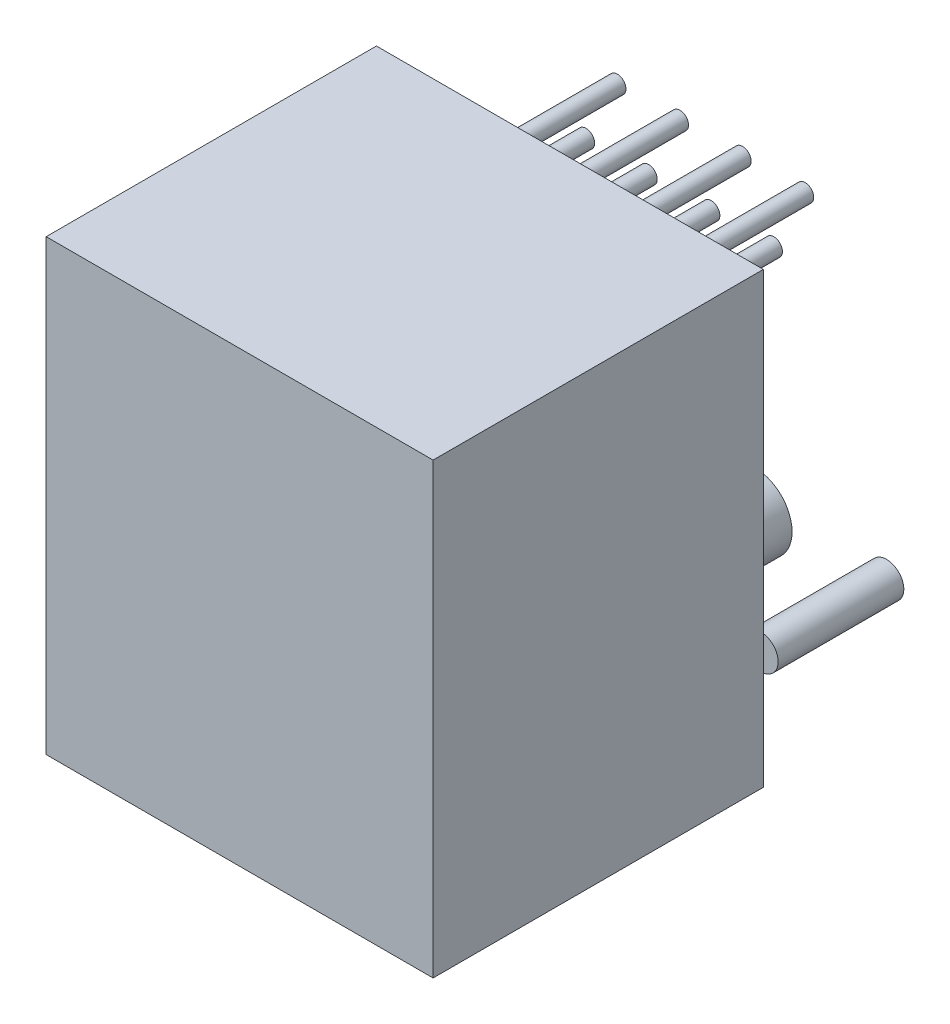
ISO-10303-21;
HEADER;
FILE_DESCRIPTION(('STEP AP214'),'2;1');
FILE_NAME('part.step','',(''),(''),'','','');
FILE_SCHEMA(('AUTOMOTIVE_DESIGN { 1 0 10303 214 1 1 1 1 }'));
ENDSEC;
DATA;
#1=APPLICATION_CONTEXT('core data for automotive mechanical design processes');
#2=APPLICATION_PROTOCOL_DEFINITION('international standard','automotive_design',2000,#1);
#3=PRODUCT_CONTEXT('',#1,'mechanical');
#4=PRODUCT('Part','Part','',(#3));
#5=PRODUCT_RELATED_PRODUCT_CATEGORY('part','',(#4));
#6=PRODUCT_DEFINITION_FORMATION('','',#4);
#7=PRODUCT_DEFINITION_CONTEXT('part definition',#1,'design');
#8=PRODUCT_DEFINITION('design','',#6,#7);
#9=PRODUCT_DEFINITION_SHAPE('','',#8);
#10=(LENGTH_UNIT() NAMED_UNIT(*) SI_UNIT(.MILLI.,.METRE.));
#11=(NAMED_UNIT(*) PLANE_ANGLE_UNIT() SI_UNIT($,.RADIAN.));
#12=(NAMED_UNIT(*) SI_UNIT($,.STERADIAN.) SOLID_ANGLE_UNIT());
#13=UNCERTAINTY_MEASURE_WITH_UNIT(LENGTH_MEASURE(1.E-05),#10,'distance_accuracy_value','');
#14=(GEOMETRIC_REPRESENTATION_CONTEXT(3) GLOBAL_UNCERTAINTY_ASSIGNED_CONTEXT((#13)) GLOBAL_UNIT_ASSIGNED_CONTEXT((#10,
#11,#12)) REPRESENTATION_CONTEXT('',''));
#15=CARTESIAN_POINT('',(0.,0.,0.));
#16=DIRECTION('',(0.,0.,1.));
#17=DIRECTION('',(1.,0.,0.));
#18=AXIS2_PLACEMENT_3D('',#15,#16,#17);
#19=CARTESIAN_POINT('',(-1.27,-6.35,0.1));
#20=DIRECTION('',(0.,0.,1.));
#21=DIRECTION('',(1.,0.,0.));
#22=AXIS2_PLACEMENT_3D('',#19,#20,#21);
#23=PLANE('',#22);
#24=CARTESIAN_POINT('',(-1.27,-6.35,0.1));
#25=DIRECTION('',(0.,0.,1.));
#26=DIRECTION('',(1.,0.,0.));
#27=AXIS2_PLACEMENT_3D('',#24,#25,#26);
#28=CIRCLE('',#27,1.5);
#29=CARTESIAN_POINT('',(0.23,-6.35,0.1));
#30=VERTEX_POINT('',#29);
#31=EDGE_CURVE('P0_E18',#30,#30,#28,.F.);
#32=ORIENTED_EDGE('',*,*,#31,.F.);
#33=EDGE_LOOP('',(#32));
#34=FACE_BOUND('',#33,.T.);
#35=ADVANCED_FACE('P0_F15',(#34),#23,.T.);
#36=CARTESIAN_POINT('',(-1.27,-6.35,-1.7));
#37=DIRECTION('',(0.,0.,1.));
#38=DIRECTION('',(1.,0.,0.));
#39=AXIS2_PLACEMENT_3D('',#36,#37,#38);
#40=PLANE('',#39);
#41=CARTESIAN_POINT('',(-1.27,-6.35,-1.7));
#42=DIRECTION('',(0.,0.,1.));
#43=DIRECTION('',(1.,0.,0.));
#44=AXIS2_PLACEMENT_3D('',#41,#42,#43);
#45=CIRCLE('',#44,1.5);
#46=CARTESIAN_POINT('',(0.23,-6.35,-1.7));
#47=VERTEX_POINT('',#46);
#48=EDGE_CURVE('P0_E10',#47,#47,#45,.T.);
#49=ORIENTED_EDGE('',*,*,#48,.F.);
#50=EDGE_LOOP('',(#49));
#51=FACE_BOUND('',#50,.T.);
#52=ADVANCED_FACE('P0_F30',(#51),#40,.F.);
#53=CARTESIAN_POINT('',(-1.27,-6.35,-1.7));
#54=DIRECTION('',(0.,0.,1.));
#55=DIRECTION('',(1.,0.,0.));
#56=AXIS2_PLACEMENT_3D('',#53,#54,#55);
#57=CYLINDRICAL_SURFACE('',#56,1.5);
#58=ORIENTED_EDGE('',*,*,#48,.T.);
#59=EDGE_LOOP('',(#58));
#60=FACE_BOUND('',#59,.T.);
#61=ORIENTED_EDGE('',*,*,#31,.T.);
#62=EDGE_LOOP('',(#61));
#63=FACE_BOUND('',#62,.T.);
#64=ADVANCED_FACE('P0_F27',(#60,#63),#57,.T.);
#65=CLOSED_SHELL('',(#35,#52,#64));
#66=MANIFOLD_SOLID_BREP('P0_B1',#65);
#67=CARTESIAN_POINT('',(-3.305,-9.4,0.1));
#68=DIRECTION('',(0.,0.,1.));
#69=DIRECTION('',(1.,0.,0.));
#70=AXIS2_PLACEMENT_3D('',#67,#68,#69);
#71=PLANE('',#70);
#72=CARTESIAN_POINT('',(-3.305,-9.4,0.1));
#73=DIRECTION('',(0.,0.,1.));
#74=DIRECTION('',(1.,0.,0.));
#75=AXIS2_PLACEMENT_3D('',#72,#73,#74);
#76=CIRCLE('',#75,0.7);
#77=CARTESIAN_POINT('',(-2.605,-9.4,0.1));
#78=VERTEX_POINT('',#77);
#79=EDGE_CURVE('P1_E18',#78,#78,#76,.F.);
#80=ORIENTED_EDGE('',*,*,#79,.F.);
#81=EDGE_LOOP('',(#80));
#82=FACE_BOUND('',#81,.T.);
#83=ADVANCED_FACE('P1_F15',(#82),#71,.T.);
#84=CARTESIAN_POINT('',(-3.305,-9.4,-5.));
#85=DIRECTION('',(0.,0.,1.));
#86=DIRECTION('',(1.,0.,0.));
#87=AXIS2_PLACEMENT_3D('',#84,#85,#86);
#88=PLANE('',#87);
#89=CARTESIAN_POINT('',(-3.305,-9.4,-5.));
#90=DIRECTION('',(0.,0.,1.));
#91=DIRECTION('',(1.,0.,0.));
#92=AXIS2_PLACEMENT_3D('',#89,#90,#91);
#93=CIRCLE('',#92,0.7);
#94=CARTESIAN_POINT('',(-2.605,-9.4,-5.));
#95=VERTEX_POINT('',#94);
#96=EDGE_CURVE('P1_E10',#95,#95,#93,.T.);
#97=ORIENTED_EDGE('',*,*,#96,.F.);
#98=EDGE_LOOP('',(#97));
#99=FACE_BOUND('',#98,.T.);
#100=ADVANCED_FACE('P1_F30',(#99),#88,.F.);
#101=CARTESIAN_POINT('',(-3.305,-9.4,-5.));
#102=DIRECTION('',(0.,0.,1.));
#103=DIRECTION('',(1.,0.,0.));
#104=AXIS2_PLACEMENT_3D('',#101,#102,#103);
#105=CYLINDRICAL_SURFACE('',#104,0.7);
#106=ORIENTED_EDGE('',*,*,#96,.T.);
#107=EDGE_LOOP('',(#106));
#108=FACE_BOUND('',#107,.T.);
#109=ORIENTED_EDGE('',*,*,#79,.T.);
#110=EDGE_LOOP('',(#109));
#111=FACE_BOUND('',#110,.T.);
#112=ADVANCED_FACE('P1_F27',(#108,#111),#105,.T.);
#113=CLOSED_SHELL('',(#83,#100,#112));
#114=MANIFOLD_SOLID_BREP('P1_B1',#113);
#115=CARTESIAN_POINT('',(4.445,-5.01,13.5));
#116=DIRECTION('',(0.,0.,-1.));
#117=DIRECTION('',(-1.,0.,0.));
#118=AXIS2_PLACEMENT_3D('',#115,#116,#117);
#119=PLANE('',#118);
#120=DIRECTION('',(1.,0.,0.));
#121=VECTOR('',#120,1.);
#122=CARTESIAN_POINT('',(12.295,-14.11,13.5));
#123=LINE('',#122,#121);
#124=CARTESIAN_POINT('',(12.295,-14.11,13.5));
#125=VERTEX_POINT('',#124);
#126=CARTESIAN_POINT('',(-3.405,-14.11,13.5));
#127=VERTEX_POINT('',#126);
#128=EDGE_CURVE('P2_E68',#125,#127,#123,.F.);
#129=ORIENTED_EDGE('',*,*,#128,.F.);
#130=DIRECTION('',(0.,1.,0.));
#131=VECTOR('',#130,1.);
#132=CARTESIAN_POINT('',(12.295,4.09,13.5));
#133=LINE('',#132,#131);
#134=CARTESIAN_POINT('',(12.295,4.09,13.5));
#135=VERTEX_POINT('',#134);
#136=EDGE_CURVE('P2_E55',#135,#125,#133,.F.);
#137=ORIENTED_EDGE('',*,*,#136,.F.);
#138=DIRECTION('',(1.,0.,0.));
#139=VECTOR('',#138,1.);
#140=CARTESIAN_POINT('',(-3.405,4.09,13.5));
#141=LINE('',#140,#139);
#142=CARTESIAN_POINT('',(-3.405,4.09,13.5));
#143=VERTEX_POINT('',#142);
#144=EDGE_CURVE('P2_E20',#143,#135,#141,.T.);
#145=ORIENTED_EDGE('',*,*,#144,.F.);
#146=DIRECTION('',(0.,1.,0.));
#147=VECTOR('',#146,1.);
#148=CARTESIAN_POINT('',(-3.405,-14.11,13.5));
#149=LINE('',#148,#147);
#150=EDGE_CURVE('P2_E80',#127,#143,#149,.T.);
#151=ORIENTED_EDGE('',*,*,#150,.F.);
#152=EDGE_LOOP('',(#129,#137,#145,#151));
#153=FACE_BOUND('',#152,.T.);
#154=ADVANCED_FACE('P2_F17',(#153),#119,.F.);
#155=CARTESIAN_POINT('',(-3.405,4.09,0.1));
#156=DIRECTION('',(0.,1.,0.));
#157=DIRECTION('',(0.,0.,1.));
#158=AXIS2_PLACEMENT_3D('',#155,#156,#157);
#159=PLANE('',#158);
#160=DIRECTION('',(0.,0.,-1.));
#161=VECTOR('',#160,1.);
#162=CARTESIAN_POINT('',(12.295,4.09,0.1));
#163=LINE('',#162,#161);
#164=CARTESIAN_POINT('',(12.295,4.09,0.1));
#165=VERTEX_POINT('',#164);
#166=EDGE_CURVE('P2_E61',#165,#135,#163,.F.);
#167=ORIENTED_EDGE('',*,*,#166,.F.);
#168=DIRECTION('',(-1.,0.,0.));
#169=VECTOR('',#168,1.);
#170=CARTESIAN_POINT('',(4.445,4.09,0.1));
#171=LINE('',#170,#169);
#172=CARTESIAN_POINT('',(-3.405,4.09,0.1));
#173=VERTEX_POINT('',#172);
#174=EDGE_CURVE('P2_E83',#173,#165,#171,.F.);
#175=ORIENTED_EDGE('',*,*,#174,.F.);
#176=DIRECTION('',(0.,0.,1.));
#177=VECTOR('',#176,1.);
#178=CARTESIAN_POINT('',(-3.405,4.09,0.1));
#179=LINE('',#178,#177);
#180=EDGE_CURVE('P2_E64',#143,#173,#179,.F.);
#181=ORIENTED_EDGE('',*,*,#180,.F.);
#182=ORIENTED_EDGE('',*,*,#144,.T.);
#183=EDGE_LOOP('',(#167,#175,#181,#182));
#184=FACE_BOUND('',#183,.T.);
#185=ADVANCED_FACE('P2_F60',(#184),#159,.T.);
#186=CARTESIAN_POINT('',(12.295,4.09,0.1));
#187=DIRECTION('',(1.,0.,0.));
#188=DIRECTION('',(0.,0.,-1.));
#189=AXIS2_PLACEMENT_3D('',#186,#187,#188);
#190=PLANE('',#189);
#191=DIRECTION('',(0.,0.,-1.));
#192=VECTOR('',#191,1.);
#193=CARTESIAN_POINT('',(12.295,-14.11,0.1));
#194=LINE('',#193,#192);
#195=CARTESIAN_POINT('',(12.295,-14.11,0.1));
#196=VERTEX_POINT('',#195);
#197=EDGE_CURVE('P2_E70',#196,#125,#194,.F.);
#198=ORIENTED_EDGE('',*,*,#197,.F.);
#199=DIRECTION('',(0.,1.,0.));
#200=VECTOR('',#199,1.);
#201=CARTESIAN_POINT('',(12.295,-5.01,0.1));
#202=LINE('',#201,#200);
#203=EDGE_CURVE('P2_E74',#165,#196,#202,.F.);
#204=ORIENTED_EDGE('',*,*,#203,.F.);
#205=ORIENTED_EDGE('',*,*,#166,.T.);
#206=ORIENTED_EDGE('',*,*,#136,.T.);
#207=EDGE_LOOP('',(#198,#204,#205,#206));
#208=FACE_BOUND('',#207,.T.);
#209=ADVANCED_FACE('P2_F72',(#208),#190,.T.);
#210=CARTESIAN_POINT('',(12.295,-14.11,0.1));
#211=DIRECTION('',(0.,-1.,0.));
#212=DIRECTION('',(0.,0.,-1.));
#213=AXIS2_PLACEMENT_3D('',#210,#211,#212);
#214=PLANE('',#213);
#215=DIRECTION('',(0.,0.,1.));
#216=VECTOR('',#215,1.);
#217=CARTESIAN_POINT('',(-3.405,-14.11,0.1));
#218=LINE('',#217,#216);
#219=CARTESIAN_POINT('',(-3.405,-14.11,0.1));
#220=VERTEX_POINT('',#219);
#221=EDGE_CURVE('P2_E35',#220,#127,#218,.T.);
#222=ORIENTED_EDGE('',*,*,#221,.F.);
#223=DIRECTION('',(-1.,0.,0.));
#224=VECTOR('',#223,1.);
#225=CARTESIAN_POINT('',(4.445,-14.11,0.1));
#226=LINE('',#225,#224);
#227=EDGE_CURVE('P2_E26',#196,#220,#226,.T.);
#228=ORIENTED_EDGE('',*,*,#227,.F.);
#229=ORIENTED_EDGE('',*,*,#197,.T.);
#230=ORIENTED_EDGE('',*,*,#128,.T.);
#231=EDGE_LOOP('',(#222,#228,#229,#230));
#232=FACE_BOUND('',#231,.T.);
#233=ADVANCED_FACE('P2_F89',(#232),#214,.T.);
#234=CARTESIAN_POINT('',(-3.405,-14.11,0.1));
#235=DIRECTION('',(-1.,0.,0.));
#236=DIRECTION('',(0.,0.,1.));
#237=AXIS2_PLACEMENT_3D('',#234,#235,#236);
#238=PLANE('',#237);
#239=ORIENTED_EDGE('',*,*,#180,.T.);
#240=DIRECTION('',(0.,1.,0.));
#241=VECTOR('',#240,1.);
#242=CARTESIAN_POINT('',(-3.405,-5.01,0.1));
#243=LINE('',#242,#241);
#244=EDGE_CURVE('P2_E11',#220,#173,#243,.T.);
#245=ORIENTED_EDGE('',*,*,#244,.F.);
#246=ORIENTED_EDGE('',*,*,#221,.T.);
#247=ORIENTED_EDGE('',*,*,#150,.T.);
#248=EDGE_LOOP('',(#239,#245,#246,#247));
#249=FACE_BOUND('',#248,.T.);
#250=ADVANCED_FACE('P2_F91',(#249),#238,.T.);
#251=CARTESIAN_POINT('',(4.445,-5.01,0.1));
#252=DIRECTION('',(0.,0.,-1.));
#253=DIRECTION('',(-1.,0.,0.));
#254=AXIS2_PLACEMENT_3D('',#251,#252,#253);
#255=PLANE('',#254);
#256=ORIENTED_EDGE('',*,*,#227,.T.);
#257=ORIENTED_EDGE('',*,*,#244,.T.);
#258=ORIENTED_EDGE('',*,*,#174,.T.);
#259=ORIENTED_EDGE('',*,*,#203,.T.);
#260=EDGE_LOOP('',(#256,#257,#258,#259));
#261=FACE_BOUND('',#260,.T.);
#262=ADVANCED_FACE('P2_F88',(#261),#255,.T.);
#263=CLOSED_SHELL('',(#154,#185,#209,#233,#250,#262));
#264=MANIFOLD_SOLID_BREP('P2_B1',#263);
#265=CARTESIAN_POINT('',(10.16,-6.35,0.1));
#266=DIRECTION('',(0.,0.,1.));
#267=DIRECTION('',(1.,0.,0.));
#268=AXIS2_PLACEMENT_3D('',#265,#266,#267);
#269=PLANE('',#268);
#270=CARTESIAN_POINT('',(10.16,-6.35,0.1));
#271=DIRECTION('',(0.,0.,1.));
#272=DIRECTION('',(1.,0.,0.));
#273=AXIS2_PLACEMENT_3D('',#270,#271,#272);
#274=CIRCLE('',#273,1.5);
#275=CARTESIAN_POINT('',(11.66,-6.35,0.1));
#276=VERTEX_POINT('',#275);
#277=EDGE_CURVE('P3_E18',#276,#276,#274,.F.);
#278=ORIENTED_EDGE('',*,*,#277,.F.);
#279=EDGE_LOOP('',(#278));
#280=FACE_BOUND('',#279,.T.);
#281=ADVANCED_FACE('P3_F15',(#280),#269,.T.);
#282=CARTESIAN_POINT('',(10.16,-6.35,-1.7));
#283=DIRECTION('',(0.,0.,1.));
#284=DIRECTION('',(1.,0.,0.));
#285=AXIS2_PLACEMENT_3D('',#282,#283,#284);
#286=PLANE('',#285);
#287=CARTESIAN_POINT('',(10.16,-6.35,-1.7));
#288=DIRECTION('',(0.,0.,1.));
#289=DIRECTION('',(1.,0.,0.));
#290=AXIS2_PLACEMENT_3D('',#287,#288,#289);
#291=CIRCLE('',#290,1.5);
#292=CARTESIAN_POINT('',(11.66,-6.35,-1.7));
#293=VERTEX_POINT('',#292);
#294=EDGE_CURVE('P3_E10',#293,#293,#291,.T.);
#295=ORIENTED_EDGE('',*,*,#294,.F.);
#296=EDGE_LOOP('',(#295));
#297=FACE_BOUND('',#296,.T.);
#298=ADVANCED_FACE('P3_F30',(#297),#286,.F.);
#299=CARTESIAN_POINT('',(10.16,-6.35,-1.7));
#300=DIRECTION('',(0.,0.,1.));
#301=DIRECTION('',(1.,0.,0.));
#302=AXIS2_PLACEMENT_3D('',#299,#300,#301);
#303=CYLINDRICAL_SURFACE('',#302,1.5);
#304=ORIENTED_EDGE('',*,*,#294,.T.);
#305=EDGE_LOOP('',(#304));
#306=FACE_BOUND('',#305,.T.);
#307=ORIENTED_EDGE('',*,*,#277,.T.);
#308=EDGE_LOOP('',(#307));
#309=FACE_BOUND('',#308,.T.);
#310=ADVANCED_FACE('P3_F27',(#306,#309),#303,.T.);
#311=CLOSED_SHELL('',(#281,#298,#310));
#312=MANIFOLD_SOLID_BREP('P3_B1',#311);
#313=CARTESIAN_POINT('',(0.,0.,0.1));
#314=DIRECTION('',(0.,0.,1.));
#315=DIRECTION('',(1.,0.,0.));
#316=AXIS2_PLACEMENT_3D('',#313,#314,#315);
#317=PLANE('',#316);
#318=CARTESIAN_POINT('',(0.,0.,0.1));
#319=DIRECTION('',(0.,0.,1.));
#320=DIRECTION('',(1.,0.,0.));
#321=AXIS2_PLACEMENT_3D('',#318,#319,#320);
#322=CIRCLE('',#321,0.35);
#323=CARTESIAN_POINT('',(0.35,0.,0.1));
#324=VERTEX_POINT('',#323);
#325=EDGE_CURVE('P4_E18',#324,#324,#322,.F.);
#326=ORIENTED_EDGE('',*,*,#325,.F.);
#327=EDGE_LOOP('',(#326));
#328=FACE_BOUND('',#327,.T.);
#329=ADVANCED_FACE('P4_F15',(#328),#317,.T.);
#330=CARTESIAN_POINT('',(0.,0.,-5.));
#331=DIRECTION('',(0.,0.,1.));
#332=DIRECTION('',(1.,0.,0.));
#333=AXIS2_PLACEMENT_3D('',#330,#331,#332);
#334=PLANE('',#333);
#335=CARTESIAN_POINT('',(0.,0.,-5.));
#336=DIRECTION('',(0.,0.,1.));
#337=DIRECTION('',(1.,0.,0.));
#338=AXIS2_PLACEMENT_3D('',#335,#336,#337);
#339=CIRCLE('',#338,0.35);
#340=CARTESIAN_POINT('',(0.35,0.,-5.));
#341=VERTEX_POINT('',#340);
#342=EDGE_CURVE('P4_E10',#341,#341,#339,.T.);
#343=ORIENTED_EDGE('',*,*,#342,.F.);
#344=EDGE_LOOP('',(#343));
#345=FACE_BOUND('',#344,.T.);
#346=ADVANCED_FACE('P4_F30',(#345),#334,.F.);
#347=CARTESIAN_POINT('',(0.,0.,-5.));
#348=DIRECTION('',(0.,0.,1.));
#349=DIRECTION('',(1.,0.,0.));
#350=AXIS2_PLACEMENT_3D('',#347,#348,#349);
#351=CYLINDRICAL_SURFACE('',#350,0.35);
#352=ORIENTED_EDGE('',*,*,#342,.T.);
#353=EDGE_LOOP('',(#352));
#354=FACE_BOUND('',#353,.T.);
#355=ORIENTED_EDGE('',*,*,#325,.T.);
#356=EDGE_LOOP('',(#355));
#357=FACE_BOUND('',#356,.T.);
#358=ADVANCED_FACE('P4_F27',(#354,#357),#351,.T.);
#359=CLOSED_SHELL('',(#329,#346,#358));
#360=MANIFOLD_SOLID_BREP('P4_B1',#359);
#361=CARTESIAN_POINT('',(5.08,0.,0.1));
#362=DIRECTION('',(0.,0.,1.));
#363=DIRECTION('',(1.,0.,0.));
#364=AXIS2_PLACEMENT_3D('',#361,#362,#363);
#365=PLANE('',#364);
#366=CARTESIAN_POINT('',(5.08,0.,0.1));
#367=DIRECTION('',(0.,0.,1.));
#368=DIRECTION('',(1.,0.,0.));
#369=AXIS2_PLACEMENT_3D('',#366,#367,#368);
#370=CIRCLE('',#369,0.35);
#371=CARTESIAN_POINT('',(5.43,0.,0.1));
#372=VERTEX_POINT('',#371);
#373=EDGE_CURVE('P5_E18',#372,#372,#370,.F.);
#374=ORIENTED_EDGE('',*,*,#373,.F.);
#375=EDGE_LOOP('',(#374));
#376=FACE_BOUND('',#375,.T.);
#377=ADVANCED_FACE('P5_F15',(#376),#365,.T.);
#378=CARTESIAN_POINT('',(5.08,0.,-5.));
#379=DIRECTION('',(0.,0.,1.));
#380=DIRECTION('',(1.,0.,0.));
#381=AXIS2_PLACEMENT_3D('',#378,#379,#380);
#382=PLANE('',#381);
#383=CARTESIAN_POINT('',(5.08,0.,-5.));
#384=DIRECTION('',(0.,0.,1.));
#385=DIRECTION('',(1.,0.,0.));
#386=AXIS2_PLACEMENT_3D('',#383,#384,#385);
#387=CIRCLE('',#386,0.35);
#388=CARTESIAN_POINT('',(5.43,0.,-5.));
#389=VERTEX_POINT('',#388);
#390=EDGE_CURVE('P5_E10',#389,#389,#387,.T.);
#391=ORIENTED_EDGE('',*,*,#390,.F.);
#392=EDGE_LOOP('',(#391));
#393=FACE_BOUND('',#392,.T.);
#394=ADVANCED_FACE('P5_F30',(#393),#382,.F.);
#395=CARTESIAN_POINT('',(5.08,0.,-5.));
#396=DIRECTION('',(0.,0.,1.));
#397=DIRECTION('',(1.,0.,0.));
#398=AXIS2_PLACEMENT_3D('',#395,#396,#397);
#399=CYLINDRICAL_SURFACE('',#398,0.35);
#400=ORIENTED_EDGE('',*,*,#390,.T.);
#401=EDGE_LOOP('',(#400));
#402=FACE_BOUND('',#401,.T.);
#403=ORIENTED_EDGE('',*,*,#373,.T.);
#404=EDGE_LOOP('',(#403));
#405=FACE_BOUND('',#404,.T.);
#406=ADVANCED_FACE('P5_F27',(#402,#405),#399,.T.);
#407=CLOSED_SHELL('',(#377,#394,#406));
#408=MANIFOLD_SOLID_BREP('P5_B1',#407);
#409=CARTESIAN_POINT('',(2.54,0.,0.1));
#410=DIRECTION('',(0.,0.,1.));
#411=DIRECTION('',(1.,0.,0.));
#412=AXIS2_PLACEMENT_3D('',#409,#410,#411);
#413=PLANE('',#412);
#414=CARTESIAN_POINT('',(2.54,0.,0.1));
#415=DIRECTION('',(0.,0.,1.));
#416=DIRECTION('',(1.,0.,0.));
#417=AXIS2_PLACEMENT_3D('',#414,#415,#416);
#418=CIRCLE('',#417,0.35);
#419=CARTESIAN_POINT('',(2.89,0.,0.1));
#420=VERTEX_POINT('',#419);
#421=EDGE_CURVE('P6_E18',#420,#420,#418,.F.);
#422=ORIENTED_EDGE('',*,*,#421,.F.);
#423=EDGE_LOOP('',(#422));
#424=FACE_BOUND('',#423,.T.);
#425=ADVANCED_FACE('P6_F15',(#424),#413,.T.);
#426=CARTESIAN_POINT('',(2.54,0.,-5.));
#427=DIRECTION('',(0.,0.,1.));
#428=DIRECTION('',(1.,0.,0.));
#429=AXIS2_PLACEMENT_3D('',#426,#427,#428);
#430=PLANE('',#429);
#431=CARTESIAN_POINT('',(2.54,0.,-5.));
#432=DIRECTION('',(0.,0.,1.));
#433=DIRECTION('',(1.,0.,0.));
#434=AXIS2_PLACEMENT_3D('',#431,#432,#433);
#435=CIRCLE('',#434,0.35);
#436=CARTESIAN_POINT('',(2.89,0.,-5.));
#437=VERTEX_POINT('',#436);
#438=EDGE_CURVE('P6_E10',#437,#437,#435,.T.);
#439=ORIENTED_EDGE('',*,*,#438,.F.);
#440=EDGE_LOOP('',(#439));
#441=FACE_BOUND('',#440,.T.);
#442=ADVANCED_FACE('P6_F30',(#441),#430,.F.);
#443=CARTESIAN_POINT('',(2.54,0.,-5.));
#444=DIRECTION('',(0.,0.,1.));
#445=DIRECTION('',(1.,0.,0.));
#446=AXIS2_PLACEMENT_3D('',#443,#444,#445);
#447=CYLINDRICAL_SURFACE('',#446,0.35);
#448=ORIENTED_EDGE('',*,*,#438,.T.);
#449=EDGE_LOOP('',(#448));
#450=FACE_BOUND('',#449,.T.);
#451=ORIENTED_EDGE('',*,*,#421,.T.);
#452=EDGE_LOOP('',(#451));
#453=FACE_BOUND('',#452,.T.);
#454=ADVANCED_FACE('P6_F27',(#450,#453),#447,.T.);
#455=CLOSED_SHELL('',(#425,#442,#454));
#456=MANIFOLD_SOLID_BREP('P6_B1',#455);
#457=CARTESIAN_POINT('',(1.27,2.54,0.1));
#458=DIRECTION('',(0.,0.,1.));
#459=DIRECTION('',(1.,0.,0.));
#460=AXIS2_PLACEMENT_3D('',#457,#458,#459);
#461=PLANE('',#460);
#462=CARTESIAN_POINT('',(1.27,2.54,0.1));
#463=DIRECTION('',(0.,0.,1.));
#464=DIRECTION('',(1.,0.,0.));
#465=AXIS2_PLACEMENT_3D('',#462,#463,#464);
#466=CIRCLE('',#465,0.35);
#467=CARTESIAN_POINT('',(1.62,2.54,0.1));
#468=VERTEX_POINT('',#467);
#469=EDGE_CURVE('P7_E18',#468,#468,#466,.F.);
#470=ORIENTED_EDGE('',*,*,#469,.F.);
#471=EDGE_LOOP('',(#470));
#472=FACE_BOUND('',#471,.T.);
#473=ADVANCED_FACE('P7_F15',(#472),#461,.T.);
#474=CARTESIAN_POINT('',(1.27,2.54,-5.));
#475=DIRECTION('',(0.,0.,1.));
#476=DIRECTION('',(1.,0.,0.));
#477=AXIS2_PLACEMENT_3D('',#474,#475,#476);
#478=PLANE('',#477);
#479=CARTESIAN_POINT('',(1.27,2.54,-5.));
#480=DIRECTION('',(0.,0.,1.));
#481=DIRECTION('',(1.,0.,0.));
#482=AXIS2_PLACEMENT_3D('',#479,#480,#481);
#483=CIRCLE('',#482,0.35);
#484=CARTESIAN_POINT('',(1.62,2.54,-5.));
#485=VERTEX_POINT('',#484);
#486=EDGE_CURVE('P7_E10',#485,#485,#483,.T.);
#487=ORIENTED_EDGE('',*,*,#486,.F.);
#488=EDGE_LOOP('',(#487));
#489=FACE_BOUND('',#488,.T.);
#490=ADVANCED_FACE('P7_F30',(#489),#478,.F.);
#491=CARTESIAN_POINT('',(1.27,2.54,-5.));
#492=DIRECTION('',(0.,0.,1.));
#493=DIRECTION('',(1.,0.,0.));
#494=AXIS2_PLACEMENT_3D('',#491,#492,#493);
#495=CYLINDRICAL_SURFACE('',#494,0.35);
#496=ORIENTED_EDGE('',*,*,#486,.T.);
#497=EDGE_LOOP('',(#496));
#498=FACE_BOUND('',#497,.T.);
#499=ORIENTED_EDGE('',*,*,#469,.T.);
#500=EDGE_LOOP('',(#499));
#501=FACE_BOUND('',#500,.T.);
#502=ADVANCED_FACE('P7_F27',(#498,#501),#495,.T.);
#503=CLOSED_SHELL('',(#473,#490,#502));
#504=MANIFOLD_SOLID_BREP('P7_B1',#503);
#505=CARTESIAN_POINT('',(3.81,2.54,0.1));
#506=DIRECTION('',(0.,0.,1.));
#507=DIRECTION('',(1.,0.,0.));
#508=AXIS2_PLACEMENT_3D('',#505,#506,#507);
#509=PLANE('',#508);
#510=CARTESIAN_POINT('',(3.81,2.54,0.1));
#511=DIRECTION('',(0.,0.,1.));
#512=DIRECTION('',(1.,0.,0.));
#513=AXIS2_PLACEMENT_3D('',#510,#511,#512);
#514=CIRCLE('',#513,0.35);
#515=CARTESIAN_POINT('',(4.16,2.54,0.1));
#516=VERTEX_POINT('',#515);
#517=EDGE_CURVE('P8_E18',#516,#516,#514,.F.);
#518=ORIENTED_EDGE('',*,*,#517,.F.);
#519=EDGE_LOOP('',(#518));
#520=FACE_BOUND('',#519,.T.);
#521=ADVANCED_FACE('P8_F15',(#520),#509,.T.);
#522=CARTESIAN_POINT('',(3.81,2.54,-5.));
#523=DIRECTION('',(0.,0.,1.));
#524=DIRECTION('',(1.,0.,0.));
#525=AXIS2_PLACEMENT_3D('',#522,#523,#524);
#526=PLANE('',#525);
#527=CARTESIAN_POINT('',(3.81,2.54,-5.));
#528=DIRECTION('',(0.,0.,1.));
#529=DIRECTION('',(1.,0.,0.));
#530=AXIS2_PLACEMENT_3D('',#527,#528,#529);
#531=CIRCLE('',#530,0.35);
#532=CARTESIAN_POINT('',(4.16,2.54,-5.));
#533=VERTEX_POINT('',#532);
#534=EDGE_CURVE('P8_E10',#533,#533,#531,.T.);
#535=ORIENTED_EDGE('',*,*,#534,.F.);
#536=EDGE_LOOP('',(#535));
#537=FACE_BOUND('',#536,.T.);
#538=ADVANCED_FACE('P8_F30',(#537),#526,.F.);
#539=CARTESIAN_POINT('',(3.81,2.54,-5.));
#540=DIRECTION('',(0.,0.,1.));
#541=DIRECTION('',(1.,0.,0.));
#542=AXIS2_PLACEMENT_3D('',#539,#540,#541);
#543=CYLINDRICAL_SURFACE('',#542,0.35);
#544=ORIENTED_EDGE('',*,*,#534,.T.);
#545=EDGE_LOOP('',(#544));
#546=FACE_BOUND('',#545,.T.);
#547=ORIENTED_EDGE('',*,*,#517,.T.);
#548=EDGE_LOOP('',(#547));
#549=FACE_BOUND('',#548,.T.);
#550=ADVANCED_FACE('P8_F27',(#546,#549),#543,.T.);
#551=CLOSED_SHELL('',(#521,#538,#550));
#552=MANIFOLD_SOLID_BREP('P8_B1',#551);
#553=CARTESIAN_POINT('',(7.62,0.,0.1));
#554=DIRECTION('',(0.,0.,1.));
#555=DIRECTION('',(1.,0.,0.));
#556=AXIS2_PLACEMENT_3D('',#553,#554,#555);
#557=PLANE('',#556);
#558=CARTESIAN_POINT('',(7.62,0.,0.1));
#559=DIRECTION('',(0.,0.,1.));
#560=DIRECTION('',(1.,0.,0.));
#561=AXIS2_PLACEMENT_3D('',#558,#559,#560);
#562=CIRCLE('',#561,0.35);
#563=CARTESIAN_POINT('',(7.97,0.,0.1));
#564=VERTEX_POINT('',#563);
#565=EDGE_CURVE('P9_E18',#564,#564,#562,.F.);
#566=ORIENTED_EDGE('',*,*,#565,.F.);
#567=EDGE_LOOP('',(#566));
#568=FACE_BOUND('',#567,.T.);
#569=ADVANCED_FACE('P9_F15',(#568),#557,.T.);
#570=CARTESIAN_POINT('',(7.62,0.,-5.));
#571=DIRECTION('',(0.,0.,1.));
#572=DIRECTION('',(1.,0.,0.));
#573=AXIS2_PLACEMENT_3D('',#570,#571,#572);
#574=PLANE('',#573);
#575=CARTESIAN_POINT('',(7.62,0.,-5.));
#576=DIRECTION('',(0.,0.,1.));
#577=DIRECTION('',(1.,0.,0.));
#578=AXIS2_PLACEMENT_3D('',#575,#576,#577);
#579=CIRCLE('',#578,0.35);
#580=CARTESIAN_POINT('',(7.97,0.,-5.));
#581=VERTEX_POINT('',#580);
#582=EDGE_CURVE('P9_E10',#581,#581,#579,.T.);
#583=ORIENTED_EDGE('',*,*,#582,.F.);
#584=EDGE_LOOP('',(#583));
#585=FACE_BOUND('',#584,.T.);
#586=ADVANCED_FACE('P9_F30',(#585),#574,.F.);
#587=CARTESIAN_POINT('',(7.62,0.,-5.));
#588=DIRECTION('',(0.,0.,1.));
#589=DIRECTION('',(1.,0.,0.));
#590=AXIS2_PLACEMENT_3D('',#587,#588,#589);
#591=CYLINDRICAL_SURFACE('',#590,0.35);
#592=ORIENTED_EDGE('',*,*,#582,.T.);
#593=EDGE_LOOP('',(#592));
#594=FACE_BOUND('',#593,.T.);
#595=ORIENTED_EDGE('',*,*,#565,.T.);
#596=EDGE_LOOP('',(#595));
#597=FACE_BOUND('',#596,.T.);
#598=ADVANCED_FACE('P9_F27',(#594,#597),#591,.T.);
#599=CLOSED_SHELL('',(#569,#586,#598));
#600=MANIFOLD_SOLID_BREP('P9_B1',#599);
#601=CARTESIAN_POINT('',(12.195,-9.4,0.1));
#602=DIRECTION('',(0.,0.,1.));
#603=DIRECTION('',(1.,0.,0.));
#604=AXIS2_PLACEMENT_3D('',#601,#602,#603);
#605=PLANE('',#604);
#606=CARTESIAN_POINT('',(12.195,-9.4,0.1));
#607=DIRECTION('',(0.,0.,1.));
#608=DIRECTION('',(1.,0.,0.));
#609=AXIS2_PLACEMENT_3D('',#606,#607,#608);
#610=CIRCLE('',#609,0.7);
#611=CARTESIAN_POINT('',(12.895,-9.4,0.1));
#612=VERTEX_POINT('',#611);
#613=EDGE_CURVE('P10_E18',#612,#612,#610,.F.);
#614=ORIENTED_EDGE('',*,*,#613,.F.);
#615=EDGE_LOOP('',(#614));
#616=FACE_BOUND('',#615,.T.);
#617=ADVANCED_FACE('P10_F15',(#616),#605,.T.);
#618=CARTESIAN_POINT('',(12.195,-9.4,-5.));
#619=DIRECTION('',(0.,0.,1.));
#620=DIRECTION('',(1.,0.,0.));
#621=AXIS2_PLACEMENT_3D('',#618,#619,#620);
#622=PLANE('',#621);
#623=CARTESIAN_POINT('',(12.195,-9.4,-5.));
#624=DIRECTION('',(0.,0.,1.));
#625=DIRECTION('',(1.,0.,0.));
#626=AXIS2_PLACEMENT_3D('',#623,#624,#625);
#627=CIRCLE('',#626,0.7);
#628=CARTESIAN_POINT('',(12.895,-9.4,-5.));
#629=VERTEX_POINT('',#628);
#630=EDGE_CURVE('P10_E10',#629,#629,#627,.T.);
#631=ORIENTED_EDGE('',*,*,#630,.F.);
#632=EDGE_LOOP('',(#631));
#633=FACE_BOUND('',#632,.T.);
#634=ADVANCED_FACE('P10_F30',(#633),#622,.F.);
#635=CARTESIAN_POINT('',(12.195,-9.4,-5.));
#636=DIRECTION('',(0.,0.,1.));
#637=DIRECTION('',(1.,0.,0.));
#638=AXIS2_PLACEMENT_3D('',#635,#636,#637);
#639=CYLINDRICAL_SURFACE('',#638,0.7);
#640=ORIENTED_EDGE('',*,*,#630,.T.);
#641=EDGE_LOOP('',(#640));
#642=FACE_BOUND('',#641,.T.);
#643=ORIENTED_EDGE('',*,*,#613,.T.);
#644=EDGE_LOOP('',(#643));
#645=FACE_BOUND('',#644,.T.);
#646=ADVANCED_FACE('P10_F27',(#642,#645),#639,.T.);
#647=CLOSED_SHELL('',(#617,#634,#646));
#648=MANIFOLD_SOLID_BREP('P10_B1',#647);
#649=CARTESIAN_POINT('',(6.35,2.54,0.1));
#650=DIRECTION('',(0.,0.,1.));
#651=DIRECTION('',(1.,0.,0.));
#652=AXIS2_PLACEMENT_3D('',#649,#650,#651);
#653=PLANE('',#652);
#654=CARTESIAN_POINT('',(6.35,2.54,0.1));
#655=DIRECTION('',(0.,0.,1.));
#656=DIRECTION('',(1.,0.,0.));
#657=AXIS2_PLACEMENT_3D('',#654,#655,#656);
#658=CIRCLE('',#657,0.35);
#659=CARTESIAN_POINT('',(6.7,2.54,0.1));
#660=VERTEX_POINT('',#659);
#661=EDGE_CURVE('P11_E18',#660,#660,#658,.F.);
#662=ORIENTED_EDGE('',*,*,#661,.F.);
#663=EDGE_LOOP('',(#662));
#664=FACE_BOUND('',#663,.T.);
#665=ADVANCED_FACE('P11_F15',(#664),#653,.T.);
#666=CARTESIAN_POINT('',(6.35,2.54,-5.));
#667=DIRECTION('',(0.,0.,1.));
#668=DIRECTION('',(1.,0.,0.));
#669=AXIS2_PLACEMENT_3D('',#666,#667,#668);
#670=PLANE('',#669);
#671=CARTESIAN_POINT('',(6.35,2.54,-5.));
#672=DIRECTION('',(0.,0.,1.));
#673=DIRECTION('',(1.,0.,0.));
#674=AXIS2_PLACEMENT_3D('',#671,#672,#673);
#675=CIRCLE('',#674,0.35);
#676=CARTESIAN_POINT('',(6.7,2.54,-5.));
#677=VERTEX_POINT('',#676);
#678=EDGE_CURVE('P11_E10',#677,#677,#675,.T.);
#679=ORIENTED_EDGE('',*,*,#678,.F.);
#680=EDGE_LOOP('',(#679));
#681=FACE_BOUND('',#680,.T.);
#682=ADVANCED_FACE('P11_F30',(#681),#670,.F.);
#683=CARTESIAN_POINT('',(6.35,2.54,-5.));
#684=DIRECTION('',(0.,0.,1.));
#685=DIRECTION('',(1.,0.,0.));
#686=AXIS2_PLACEMENT_3D('',#683,#684,#685);
#687=CYLINDRICAL_SURFACE('',#686,0.35);
#688=ORIENTED_EDGE('',*,*,#678,.T.);
#689=EDGE_LOOP('',(#688));
#690=FACE_BOUND('',#689,.T.);
#691=ORIENTED_EDGE('',*,*,#661,.T.);
#692=EDGE_LOOP('',(#691));
#693=FACE_BOUND('',#692,.T.);
#694=ADVANCED_FACE('P11_F27',(#690,#693),#687,.T.);
#695=CLOSED_SHELL('',(#665,#682,#694));
#696=MANIFOLD_SOLID_BREP('P11_B1',#695);
#697=CARTESIAN_POINT('',(8.89,2.54,0.1));
#698=DIRECTION('',(0.,0.,1.));
#699=DIRECTION('',(1.,0.,0.));
#700=AXIS2_PLACEMENT_3D('',#697,#698,#699);
#701=PLANE('',#700);
#702=CARTESIAN_POINT('',(8.89,2.54,0.1));
#703=DIRECTION('',(0.,0.,1.));
#704=DIRECTION('',(1.,0.,0.));
#705=AXIS2_PLACEMENT_3D('',#702,#703,#704);
#706=CIRCLE('',#705,0.35);
#707=CARTESIAN_POINT('',(9.24,2.54,0.1));
#708=VERTEX_POINT('',#707);
#709=EDGE_CURVE('P12_E18',#708,#708,#706,.F.);
#710=ORIENTED_EDGE('',*,*,#709,.F.);
#711=EDGE_LOOP('',(#710));
#712=FACE_BOUND('',#711,.T.);
#713=ADVANCED_FACE('P12_F15',(#712),#701,.T.);
#714=CARTESIAN_POINT('',(8.89,2.54,-5.));
#715=DIRECTION('',(0.,0.,1.));
#716=DIRECTION('',(1.,0.,0.));
#717=AXIS2_PLACEMENT_3D('',#714,#715,#716);
#718=PLANE('',#717);
#719=CARTESIAN_POINT('',(8.89,2.54,-5.));
#720=DIRECTION('',(0.,0.,1.));
#721=DIRECTION('',(1.,0.,0.));
#722=AXIS2_PLACEMENT_3D('',#719,#720,#721);
#723=CIRCLE('',#722,0.35);
#724=CARTESIAN_POINT('',(9.24,2.54,-5.));
#725=VERTEX_POINT('',#724);
#726=EDGE_CURVE('P12_E10',#725,#725,#723,.T.);
#727=ORIENTED_EDGE('',*,*,#726,.F.);
#728=EDGE_LOOP('',(#727));
#729=FACE_BOUND('',#728,.T.);
#730=ADVANCED_FACE('P12_F30',(#729),#718,.F.);
#731=CARTESIAN_POINT('',(8.89,2.54,-5.));
#732=DIRECTION('',(0.,0.,1.));
#733=DIRECTION('',(1.,0.,0.));
#734=AXIS2_PLACEMENT_3D('',#731,#732,#733);
#735=CYLINDRICAL_SURFACE('',#734,0.35);
#736=ORIENTED_EDGE('',*,*,#726,.T.);
#737=EDGE_LOOP('',(#736));
#738=FACE_BOUND('',#737,.T.);
#739=ORIENTED_EDGE('',*,*,#709,.T.);
#740=EDGE_LOOP('',(#739));
#741=FACE_BOUND('',#740,.T.);
#742=ADVANCED_FACE('P12_F27',(#738,#741),#735,.T.);
#743=CLOSED_SHELL('',(#713,#730,#742));
#744=MANIFOLD_SOLID_BREP('P12_B1',#743);
#745=ADVANCED_BREP_SHAPE_REPRESENTATION('',(#18,#66,#114,#264,#312,#360,#408,#456,#504,#552,
#600,#648,#696,#744),#14);
#746=SHAPE_DEFINITION_REPRESENTATION(#9,#745);
ENDSEC;
END-ISO-10303-21;
